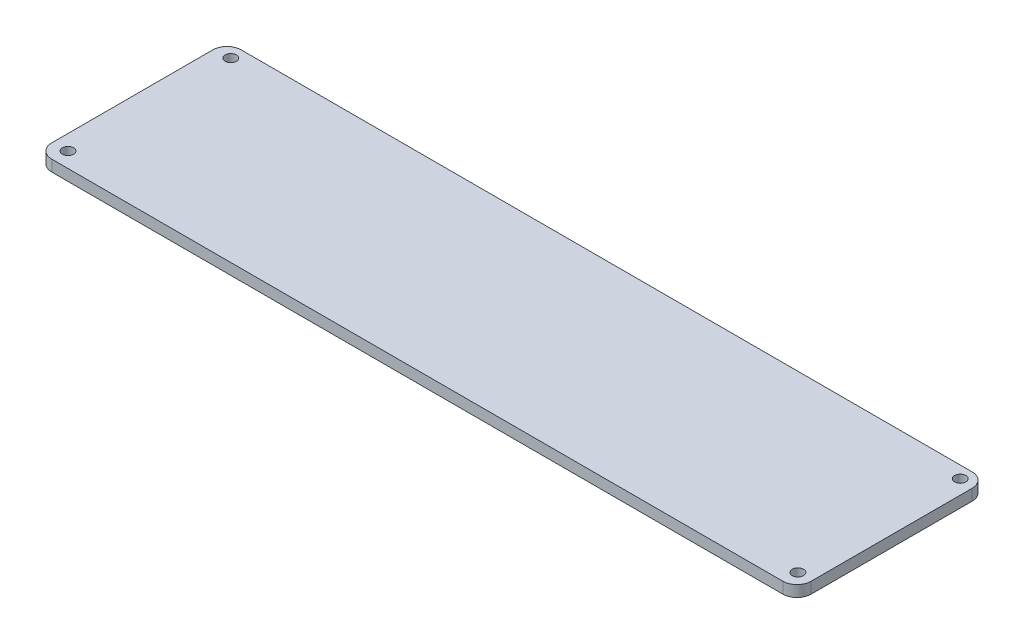
ISO-10303-21;
HEADER;
FILE_DESCRIPTION(('STEP AP214'),'2;1');
FILE_NAME('part.step','',(''),(''),'','','');
FILE_SCHEMA(('AUTOMOTIVE_DESIGN { 1 0 10303 214 1 1 1 1 }'));
ENDSEC;
DATA;
#1=APPLICATION_CONTEXT('core data for automotive mechanical design processes');
#2=APPLICATION_PROTOCOL_DEFINITION('international standard','automotive_design',2000,#1);
#3=PRODUCT_CONTEXT('',#1,'mechanical');
#4=PRODUCT('Part','Part','',(#3));
#5=PRODUCT_RELATED_PRODUCT_CATEGORY('part','',(#4));
#6=PRODUCT_DEFINITION_FORMATION('','',#4);
#7=PRODUCT_DEFINITION_CONTEXT('part definition',#1,'design');
#8=PRODUCT_DEFINITION('design','',#6,#7);
#9=PRODUCT_DEFINITION_SHAPE('','',#8);
#10=(LENGTH_UNIT() NAMED_UNIT(*) SI_UNIT(.MILLI.,.METRE.));
#11=(NAMED_UNIT(*) PLANE_ANGLE_UNIT() SI_UNIT($,.RADIAN.));
#12=(NAMED_UNIT(*) SI_UNIT($,.STERADIAN.) SOLID_ANGLE_UNIT());
#13=UNCERTAINTY_MEASURE_WITH_UNIT(LENGTH_MEASURE(1.E-05),#10,'distance_accuracy_value','');
#14=(GEOMETRIC_REPRESENTATION_CONTEXT(3) GLOBAL_UNCERTAINTY_ASSIGNED_CONTEXT((#13)) GLOBAL_UNIT_ASSIGNED_CONTEXT((#10,
#11,#12)) REPRESENTATION_CONTEXT('',''));
#15=CARTESIAN_POINT('',(0.,0.,0.));
#16=DIRECTION('',(0.,0.,1.));
#17=DIRECTION('',(1.,0.,0.));
#18=AXIS2_PLACEMENT_3D('',#15,#16,#17);
#19=CARTESIAN_POINT('',(0.,3.,24.3535233685462));
#20=DIRECTION('',(0.,0.,-1.));
#21=DIRECTION('',(-1.,0.,0.));
#22=AXIS2_PLACEMENT_3D('',#19,#20,#21);
#23=PLANE('',#22);
#24=DIRECTION('',(1.,0.,0.));
#25=VECTOR('',#24,1.);
#26=CARTESIAN_POINT('',(0.,0.,24.3535233685462));
#27=LINE('',#26,#25);
#28=CARTESIAN_POINT('',(-98.5863813051631,0.,24.3535233685462));
#29=VERTEX_POINT('',#28);
#30=CARTESIAN_POINT('',(97.0136186948369,0.,24.3535233685462));
#31=VERTEX_POINT('',#30);
#32=EDGE_CURVE('E106',#29,#31,#27,.T.);
#33=ORIENTED_EDGE('',*,*,#32,.T.);
#34=DIRECTION('',(0.,-1.,0.));
#35=VECTOR('',#34,1.);
#36=CARTESIAN_POINT('',(97.0136186948369,3.,24.3535233685462));
#37=LINE('',#36,#35);
#38=CARTESIAN_POINT('',(97.0136186948369,3.,24.3535233685462));
#39=VERTEX_POINT('',#38);
#40=EDGE_CURVE('E11',#31,#39,#37,.F.);
#41=ORIENTED_EDGE('',*,*,#40,.T.);
#42=DIRECTION('',(1.,0.,0.));
#43=VECTOR('',#42,1.);
#44=CARTESIAN_POINT('',(0.,3.,24.3535233685462));
#45=LINE('',#44,#43);
#46=CARTESIAN_POINT('',(-98.5863813051631,3.,24.3535233685462));
#47=VERTEX_POINT('',#46);
#48=EDGE_CURVE('E155',#47,#39,#45,.T.);
#49=ORIENTED_EDGE('',*,*,#48,.F.);
#50=DIRECTION('',(0.,-1.,0.));
#51=VECTOR('',#50,1.);
#52=CARTESIAN_POINT('',(-98.5863813051631,0.,24.3535233685462));
#53=LINE('',#52,#51);
#54=EDGE_CURVE('E43',#47,#29,#53,.T.);
#55=ORIENTED_EDGE('',*,*,#54,.T.);
#56=EDGE_LOOP('',(#33,#41,#49,#55));
#57=FACE_BOUND('',#56,.T.);
#58=ADVANCED_FACE('F35',(#57),#23,.F.);
#59=CARTESIAN_POINT('',(100.813618694837,3.,0.));
#60=DIRECTION('',(-1.,0.,0.));
#61=DIRECTION('',(0.,0.,1.));
#62=AXIS2_PLACEMENT_3D('',#59,#60,#61);
#63=PLANE('',#62);
#64=DIRECTION('',(0.,0.,-1.));
#65=VECTOR('',#64,1.);
#66=CARTESIAN_POINT('',(100.813618694837,0.,0.));
#67=LINE('',#66,#65);
#68=CARTESIAN_POINT('',(100.813618694837,0.,20.5535233685462));
#69=VERTEX_POINT('',#68);
#70=CARTESIAN_POINT('',(100.813618694837,0.,-22.5194766314538));
#71=VERTEX_POINT('',#70);
#72=EDGE_CURVE('E180',#69,#71,#67,.T.);
#73=ORIENTED_EDGE('',*,*,#72,.T.);
#74=DIRECTION('',(0.,-1.,0.));
#75=VECTOR('',#74,1.);
#76=CARTESIAN_POINT('',(100.813618694837,3.,-22.5194766314538));
#77=LINE('',#76,#75);
#78=CARTESIAN_POINT('',(100.813618694837,3.,-22.5194766314538));
#79=VERTEX_POINT('',#78);
#80=EDGE_CURVE('E50',#71,#79,#77,.F.);
#81=ORIENTED_EDGE('',*,*,#80,.T.);
#82=DIRECTION('',(0.,0.,-1.));
#83=VECTOR('',#82,1.);
#84=CARTESIAN_POINT('',(100.813618694837,3.,0.));
#85=LINE('',#84,#83);
#86=CARTESIAN_POINT('',(100.813618694837,3.,20.5535233685462));
#87=VERTEX_POINT('',#86);
#88=EDGE_CURVE('E156',#87,#79,#85,.T.);
#89=ORIENTED_EDGE('',*,*,#88,.F.);
#90=DIRECTION('',(0.,-1.,0.));
#91=VECTOR('',#90,1.);
#92=CARTESIAN_POINT('',(100.813618694837,3.,20.5535233685462));
#93=LINE('',#92,#91);
#94=EDGE_CURVE('E149',#87,#69,#93,.T.);
#95=ORIENTED_EDGE('',*,*,#94,.T.);
#96=EDGE_LOOP('',(#73,#81,#89,#95));
#97=FACE_BOUND('',#96,.T.);
#98=ADVANCED_FACE('F206',(#97),#63,.F.);
#99=CARTESIAN_POINT('',(0.,3.,-26.3194766314538));
#100=DIRECTION('',(0.,0.,-1.));
#101=DIRECTION('',(-1.,0.,0.));
#102=AXIS2_PLACEMENT_3D('',#99,#100,#101);
#103=PLANE('',#102);
#104=DIRECTION('',(1.,0.,0.));
#105=VECTOR('',#104,1.);
#106=CARTESIAN_POINT('',(0.,0.,-26.3194766314538));
#107=LINE('',#106,#105);
#108=CARTESIAN_POINT('',(-98.5863813051631,0.,-26.3194766314538));
#109=VERTEX_POINT('',#108);
#110=CARTESIAN_POINT('',(97.0136186948369,0.,-26.3194766314538));
#111=VERTEX_POINT('',#110);
#112=EDGE_CURVE('E122',#109,#111,#107,.T.);
#113=ORIENTED_EDGE('',*,*,#112,.F.);
#114=DIRECTION('',(0.,-1.,0.));
#115=VECTOR('',#114,1.);
#116=CARTESIAN_POINT('',(-98.5863813051631,3.,-26.3194766314538));
#117=LINE('',#116,#115);
#118=CARTESIAN_POINT('',(-98.5863813051631,3.,-26.3194766314538));
#119=VERTEX_POINT('',#118);
#120=EDGE_CURVE('E141',#109,#119,#117,.F.);
#121=ORIENTED_EDGE('',*,*,#120,.T.);
#122=DIRECTION('',(1.,0.,0.));
#123=VECTOR('',#122,1.);
#124=CARTESIAN_POINT('',(0.,3.,-26.3194766314538));
#125=LINE('',#124,#123);
#126=CARTESIAN_POINT('',(97.0136186948369,3.,-26.3194766314538));
#127=VERTEX_POINT('',#126);
#128=EDGE_CURVE('E129',#119,#127,#125,.T.);
#129=ORIENTED_EDGE('',*,*,#128,.T.);
#130=DIRECTION('',(0.,-1.,0.));
#131=VECTOR('',#130,1.);
#132=CARTESIAN_POINT('',(97.0136186948369,0.,-26.3194766314538));
#133=LINE('',#132,#131);
#134=EDGE_CURVE('E138',#127,#111,#133,.T.);
#135=ORIENTED_EDGE('',*,*,#134,.T.);
#136=EDGE_LOOP('',(#113,#121,#129,#135));
#137=FACE_BOUND('',#136,.T.);
#138=ADVANCED_FACE('F186',(#137),#103,.T.);
#139=CARTESIAN_POINT('',(-98.3223813051631,3.,20.2895233685462));
#140=DIRECTION('',(0.,-1.,0.));
#141=DIRECTION('',(0.,0.,-1.));
#142=AXIS2_PLACEMENT_3D('',#139,#140,#141);
#143=CYLINDRICAL_SURFACE('',#142,1.5);
#144=CARTESIAN_POINT('',(-98.3223813051631,3.,20.2895233685462));
#145=DIRECTION('',(0.,1.,0.));
#146=DIRECTION('',(0.,0.,1.));
#147=AXIS2_PLACEMENT_3D('',#144,#145,#146);
#148=CIRCLE('',#147,1.5);
#149=CARTESIAN_POINT('',(-98.3223813051631,3.,21.7895233685462));
#150=VERTEX_POINT('',#149);
#151=EDGE_CURVE('E157',#150,#150,#148,.T.);
#152=ORIENTED_EDGE('',*,*,#151,.T.);
#153=EDGE_LOOP('',(#152));
#154=FACE_BOUND('',#153,.T.);
#155=CARTESIAN_POINT('',(-98.3223813051631,0.,20.2895233685462));
#156=DIRECTION('',(0.,1.,0.));
#157=DIRECTION('',(0.,0.,1.));
#158=AXIS2_PLACEMENT_3D('',#155,#156,#157);
#159=CIRCLE('',#158,1.5);
#160=CARTESIAN_POINT('',(-98.3223813051631,0.,21.7895233685462));
#161=VERTEX_POINT('',#160);
#162=EDGE_CURVE('E176',#161,#161,#159,.T.);
#163=ORIENTED_EDGE('',*,*,#162,.F.);
#164=EDGE_LOOP('',(#163));
#165=FACE_BOUND('',#164,.T.);
#166=ADVANCED_FACE('F214',(#154,#165),#143,.F.);
#167=CARTESIAN_POINT('',(-98.0683813051631,3.,-23.0174766314538));
#168=DIRECTION('',(0.,-1.,0.));
#169=DIRECTION('',(0.,0.,-1.));
#170=AXIS2_PLACEMENT_3D('',#167,#168,#169);
#171=CYLINDRICAL_SURFACE('',#170,1.5);
#172=CARTESIAN_POINT('',(-98.0683813051631,3.,-23.0174766314538));
#173=DIRECTION('',(0.,1.,0.));
#174=DIRECTION('',(0.,0.,1.));
#175=AXIS2_PLACEMENT_3D('',#172,#173,#174);
#176=CIRCLE('',#175,1.5);
#177=CARTESIAN_POINT('',(-98.0683813051631,3.,-21.5174766314538));
#178=VERTEX_POINT('',#177);
#179=EDGE_CURVE('E161',#178,#178,#176,.T.);
#180=ORIENTED_EDGE('',*,*,#179,.T.);
#181=EDGE_LOOP('',(#180));
#182=FACE_BOUND('',#181,.T.);
#183=CARTESIAN_POINT('',(-98.0683813051631,0.,-23.0174766314538));
#184=DIRECTION('',(0.,1.,0.));
#185=DIRECTION('',(0.,0.,1.));
#186=AXIS2_PLACEMENT_3D('',#183,#184,#185);
#187=CIRCLE('',#186,1.5);
#188=CARTESIAN_POINT('',(-98.0683813051631,0.,-21.5174766314538));
#189=VERTEX_POINT('',#188);
#190=EDGE_CURVE('E173',#189,#189,#187,.T.);
#191=ORIENTED_EDGE('',*,*,#190,.F.);
#192=EDGE_LOOP('',(#191));
#193=FACE_BOUND('',#192,.T.);
#194=ADVANCED_FACE('F217',(#182,#193),#171,.F.);
#195=CARTESIAN_POINT('',(97.0036186948369,3.,-23.1444766314538));
#196=DIRECTION('',(0.,-1.,0.));
#197=DIRECTION('',(0.,0.,-1.));
#198=AXIS2_PLACEMENT_3D('',#195,#196,#197);
#199=CYLINDRICAL_SURFACE('',#198,1.5);
#200=CARTESIAN_POINT('',(97.0036186948369,3.,-23.1444766314538));
#201=DIRECTION('',(0.,1.,0.));
#202=DIRECTION('',(0.,0.,1.));
#203=AXIS2_PLACEMENT_3D('',#200,#201,#202);
#204=CIRCLE('',#203,1.5);
#205=CARTESIAN_POINT('',(97.0036186948369,3.,-21.6444766314538));
#206=VERTEX_POINT('',#205);
#207=EDGE_CURVE('E339',#206,#206,#204,.T.);
#208=ORIENTED_EDGE('',*,*,#207,.T.);
#209=EDGE_LOOP('',(#208));
#210=FACE_BOUND('',#209,.T.);
#211=CARTESIAN_POINT('',(97.0036186948369,0.,-23.1444766314538));
#212=DIRECTION('',(0.,1.,0.));
#213=DIRECTION('',(0.,0.,1.));
#214=AXIS2_PLACEMENT_3D('',#211,#212,#213);
#215=CIRCLE('',#214,1.5);
#216=CARTESIAN_POINT('',(97.0036186948369,0.,-21.6444766314538));
#217=VERTEX_POINT('',#216);
#218=EDGE_CURVE('E170',#217,#217,#215,.T.);
#219=ORIENTED_EDGE('',*,*,#218,.F.);
#220=EDGE_LOOP('',(#219));
#221=FACE_BOUND('',#220,.T.);
#222=ADVANCED_FACE('F221',(#210,#221),#199,.F.);
#223=CARTESIAN_POINT('',(97.0036186948369,3.,20.2895233685462));
#224=DIRECTION('',(0.,-1.,0.));
#225=DIRECTION('',(0.,0.,-1.));
#226=AXIS2_PLACEMENT_3D('',#223,#224,#225);
#227=CYLINDRICAL_SURFACE('',#226,1.5);
#228=CARTESIAN_POINT('',(97.0036186948369,3.,20.2895233685462));
#229=DIRECTION('',(0.,1.,0.));
#230=DIRECTION('',(0.,0.,1.));
#231=AXIS2_PLACEMENT_3D('',#228,#229,#230);
#232=CIRCLE('',#231,1.5);
#233=CARTESIAN_POINT('',(97.0036186948369,3.,21.7895233685462));
#234=VERTEX_POINT('',#233);
#235=EDGE_CURVE('E121',#234,#234,#232,.T.);
#236=ORIENTED_EDGE('',*,*,#235,.T.);
#237=EDGE_LOOP('',(#236));
#238=FACE_BOUND('',#237,.T.);
#239=CARTESIAN_POINT('',(97.0036186948369,0.,20.2895233685462));
#240=DIRECTION('',(0.,1.,0.));
#241=DIRECTION('',(0.,0.,1.));
#242=AXIS2_PLACEMENT_3D('',#239,#240,#241);
#243=CIRCLE('',#242,1.5);
#244=CARTESIAN_POINT('',(97.0036186948369,0.,21.7895233685462));
#245=VERTEX_POINT('',#244);
#246=EDGE_CURVE('E167',#245,#245,#243,.T.);
#247=ORIENTED_EDGE('',*,*,#246,.F.);
#248=EDGE_LOOP('',(#247));
#249=FACE_BOUND('',#248,.T.);
#250=ADVANCED_FACE('F225',(#238,#249),#227,.F.);
#251=CARTESIAN_POINT('',(-102.386381305163,3.,0.));
#252=DIRECTION('',(-1.,0.,0.));
#253=DIRECTION('',(0.,0.,1.));
#254=AXIS2_PLACEMENT_3D('',#251,#252,#253);
#255=PLANE('',#254);
#256=DIRECTION('',(0.,0.,-1.));
#257=VECTOR('',#256,1.);
#258=CARTESIAN_POINT('',(-102.386381305163,3.,0.));
#259=LINE('',#258,#257);
#260=CARTESIAN_POINT('',(-102.386381305163,3.,20.5535233685462));
#261=VERTEX_POINT('',#260);
#262=CARTESIAN_POINT('',(-102.386381305163,3.,-22.5194766314538));
#263=VERTEX_POINT('',#262);
#264=EDGE_CURVE('E126',#261,#263,#259,.T.);
#265=ORIENTED_EDGE('',*,*,#264,.T.);
#266=DIRECTION('',(0.,-1.,0.));
#267=VECTOR('',#266,1.);
#268=CARTESIAN_POINT('',(-102.386381305163,3.,-22.5194766314538));
#269=LINE('',#268,#267);
#270=CARTESIAN_POINT('',(-102.386381305163,0.,-22.5194766314538));
#271=VERTEX_POINT('',#270);
#272=EDGE_CURVE('E112',#263,#271,#269,.T.);
#273=ORIENTED_EDGE('',*,*,#272,.T.);
#274=DIRECTION('',(0.,0.,-1.));
#275=VECTOR('',#274,1.);
#276=CARTESIAN_POINT('',(-102.386381305163,0.,0.));
#277=LINE('',#276,#275);
#278=CARTESIAN_POINT('',(-102.386381305163,0.,20.5535233685462));
#279=VERTEX_POINT('',#278);
#280=EDGE_CURVE('E104',#279,#271,#277,.T.);
#281=ORIENTED_EDGE('',*,*,#280,.F.);
#282=DIRECTION('',(0.,-1.,0.));
#283=VECTOR('',#282,1.);
#284=CARTESIAN_POINT('',(-102.386381305163,3.,20.5535233685462));
#285=LINE('',#284,#283);
#286=EDGE_CURVE('E118',#279,#261,#285,.F.);
#287=ORIENTED_EDGE('',*,*,#286,.T.);
#288=EDGE_LOOP('',(#265,#273,#281,#287));
#289=FACE_BOUND('',#288,.T.);
#290=ADVANCED_FACE('F117',(#289),#255,.T.);
#291=CARTESIAN_POINT('',(0.,3.,0.));
#292=DIRECTION('',(0.,1.,0.));
#293=DIRECTION('',(0.,0.,1.));
#294=AXIS2_PLACEMENT_3D('',#291,#292,#293);
#295=PLANE('',#294);
#296=ORIENTED_EDGE('',*,*,#235,.F.);
#297=EDGE_LOOP('',(#296));
#298=FACE_BOUND('',#297,.T.);
#299=ORIENTED_EDGE('',*,*,#207,.F.);
#300=EDGE_LOOP('',(#299));
#301=FACE_BOUND('',#300,.T.);
#302=ORIENTED_EDGE('',*,*,#179,.F.);
#303=EDGE_LOOP('',(#302));
#304=FACE_BOUND('',#303,.T.);
#305=ORIENTED_EDGE('',*,*,#151,.F.);
#306=EDGE_LOOP('',(#305));
#307=FACE_BOUND('',#306,.T.);
#308=ORIENTED_EDGE('',*,*,#128,.F.);
#309=CARTESIAN_POINT('',(-98.5863813051631,3.,-22.5194766314538));
#310=DIRECTION('',(0.,1.,0.));
#311=DIRECTION('',(0.,0.,1.));
#312=AXIS2_PLACEMENT_3D('',#309,#310,#311);
#313=CIRCLE('',#312,3.8);
#314=EDGE_CURVE('E147',#119,#263,#313,.T.);
#315=ORIENTED_EDGE('',*,*,#314,.T.);
#316=ORIENTED_EDGE('',*,*,#264,.F.);
#317=CARTESIAN_POINT('',(-98.5863813051631,3.,20.5535233685462));
#318=DIRECTION('',(0.,1.,0.));
#319=DIRECTION('',(0.,0.,1.));
#320=AXIS2_PLACEMENT_3D('',#317,#318,#319);
#321=CIRCLE('',#320,3.8);
#322=EDGE_CURVE('E125',#261,#47,#321,.T.);
#323=ORIENTED_EDGE('',*,*,#322,.T.);
#324=ORIENTED_EDGE('',*,*,#48,.T.);
#325=CARTESIAN_POINT('',(97.0136186948369,3.,20.5535233685462));
#326=DIRECTION('',(0.,1.,0.));
#327=DIRECTION('',(0.,0.,1.));
#328=AXIS2_PLACEMENT_3D('',#325,#326,#327);
#329=CIRCLE('',#328,3.8);
#330=EDGE_CURVE('E57',#39,#87,#329,.T.);
#331=ORIENTED_EDGE('',*,*,#330,.T.);
#332=ORIENTED_EDGE('',*,*,#88,.T.);
#333=CARTESIAN_POINT('',(97.0136186948369,3.,-22.5194766314538));
#334=DIRECTION('',(0.,1.,0.));
#335=DIRECTION('',(0.,0.,1.));
#336=AXIS2_PLACEMENT_3D('',#333,#334,#335);
#337=CIRCLE('',#336,3.8);
#338=EDGE_CURVE('E145',#79,#127,#337,.T.);
#339=ORIENTED_EDGE('',*,*,#338,.T.);
#340=EDGE_LOOP('',(#308,#315,#316,#323,#324,#331,#332,#339));
#341=FACE_BOUND('',#340,.T.);
#342=ADVANCED_FACE('F192',(#298,#301,#304,#307,#341),#295,.T.);
#343=CARTESIAN_POINT('',(0.,0.,0.));
#344=DIRECTION('',(0.,1.,0.));
#345=DIRECTION('',(0.,0.,1.));
#346=AXIS2_PLACEMENT_3D('',#343,#344,#345);
#347=PLANE('',#346);
#348=ORIENTED_EDGE('',*,*,#246,.T.);
#349=EDGE_LOOP('',(#348));
#350=FACE_BOUND('',#349,.T.);
#351=ORIENTED_EDGE('',*,*,#218,.T.);
#352=EDGE_LOOP('',(#351));
#353=FACE_BOUND('',#352,.T.);
#354=ORIENTED_EDGE('',*,*,#190,.T.);
#355=EDGE_LOOP('',(#354));
#356=FACE_BOUND('',#355,.T.);
#357=ORIENTED_EDGE('',*,*,#162,.T.);
#358=EDGE_LOOP('',(#357));
#359=FACE_BOUND('',#358,.T.);
#360=ORIENTED_EDGE('',*,*,#280,.T.);
#361=CARTESIAN_POINT('',(-98.5863813051631,0.,-22.5194766314538));
#362=DIRECTION('',(0.,1.,0.));
#363=DIRECTION('',(0.,0.,1.));
#364=AXIS2_PLACEMENT_3D('',#361,#362,#363);
#365=CIRCLE('',#364,3.8);
#366=EDGE_CURVE('E136',#271,#109,#365,.F.);
#367=ORIENTED_EDGE('',*,*,#366,.T.);
#368=ORIENTED_EDGE('',*,*,#112,.T.);
#369=CARTESIAN_POINT('',(97.0136186948369,0.,-22.5194766314538));
#370=DIRECTION('',(0.,1.,0.));
#371=DIRECTION('',(0.,0.,1.));
#372=AXIS2_PLACEMENT_3D('',#369,#370,#371);
#373=CIRCLE('',#372,3.8);
#374=EDGE_CURVE('E134',#111,#71,#373,.F.);
#375=ORIENTED_EDGE('',*,*,#374,.T.);
#376=ORIENTED_EDGE('',*,*,#72,.F.);
#377=CARTESIAN_POINT('',(97.0136186948369,0.,20.5535233685462));
#378=DIRECTION('',(0.,1.,0.));
#379=DIRECTION('',(0.,0.,1.));
#380=AXIS2_PLACEMENT_3D('',#377,#378,#379);
#381=CIRCLE('',#380,3.8);
#382=EDGE_CURVE('E111',#69,#31,#381,.F.);
#383=ORIENTED_EDGE('',*,*,#382,.T.);
#384=ORIENTED_EDGE('',*,*,#32,.F.);
#385=CARTESIAN_POINT('',(-98.5863813051631,0.,20.5535233685462));
#386=DIRECTION('',(0.,1.,0.));
#387=DIRECTION('',(0.,0.,1.));
#388=AXIS2_PLACEMENT_3D('',#385,#386,#387);
#389=CIRCLE('',#388,3.8);
#390=EDGE_CURVE('E101',#29,#279,#389,.F.);
#391=ORIENTED_EDGE('',*,*,#390,.T.);
#392=EDGE_LOOP('',(#360,#367,#368,#375,#376,#383,#384,#391));
#393=FACE_BOUND('',#392,.T.);
#394=ADVANCED_FACE('F103',(#350,#353,#356,#359,#393),#347,.F.);
#395=CARTESIAN_POINT('',(-98.5863813051631,3.,-22.5194766314538));
#396=DIRECTION('',(0.,-1.,0.));
#397=DIRECTION('',(0.,0.,-1.));
#398=AXIS2_PLACEMENT_3D('',#395,#396,#397);
#399=CYLINDRICAL_SURFACE('',#398,3.8);
#400=ORIENTED_EDGE('',*,*,#314,.F.);
#401=ORIENTED_EDGE('',*,*,#120,.F.);
#402=ORIENTED_EDGE('',*,*,#366,.F.);
#403=ORIENTED_EDGE('',*,*,#272,.F.);
#404=EDGE_LOOP('',(#400,#401,#402,#403));
#405=FACE_BOUND('',#404,.T.);
#406=ADVANCED_FACE('F191',(#405),#399,.T.);
#407=CARTESIAN_POINT('',(97.0136186948369,3.,-22.5194766314538));
#408=DIRECTION('',(0.,1.,0.));
#409=DIRECTION('',(0.,0.,1.));
#410=AXIS2_PLACEMENT_3D('',#407,#408,#409);
#411=CYLINDRICAL_SURFACE('',#410,3.8);
#412=ORIENTED_EDGE('',*,*,#338,.F.);
#413=ORIENTED_EDGE('',*,*,#80,.F.);
#414=ORIENTED_EDGE('',*,*,#374,.F.);
#415=ORIENTED_EDGE('',*,*,#134,.F.);
#416=EDGE_LOOP('',(#412,#413,#414,#415));
#417=FACE_BOUND('',#416,.T.);
#418=ADVANCED_FACE('F195',(#417),#411,.T.);
#419=CARTESIAN_POINT('',(97.0136186948369,3.,20.5535233685462));
#420=DIRECTION('',(0.,-1.,0.));
#421=DIRECTION('',(0.,0.,-1.));
#422=AXIS2_PLACEMENT_3D('',#419,#420,#421);
#423=CYLINDRICAL_SURFACE('',#422,3.8);
#424=ORIENTED_EDGE('',*,*,#330,.F.);
#425=ORIENTED_EDGE('',*,*,#40,.F.);
#426=ORIENTED_EDGE('',*,*,#382,.F.);
#427=ORIENTED_EDGE('',*,*,#94,.F.);
#428=EDGE_LOOP('',(#424,#425,#426,#427));
#429=FACE_BOUND('',#428,.T.);
#430=ADVANCED_FACE('F197',(#429),#423,.T.);
#431=CARTESIAN_POINT('',(-98.5863813051631,3.,20.5535233685462));
#432=DIRECTION('',(0.,1.,0.));
#433=DIRECTION('',(0.,0.,1.));
#434=AXIS2_PLACEMENT_3D('',#431,#432,#433);
#435=CYLINDRICAL_SURFACE('',#434,3.8);
#436=ORIENTED_EDGE('',*,*,#322,.F.);
#437=ORIENTED_EDGE('',*,*,#286,.F.);
#438=ORIENTED_EDGE('',*,*,#390,.F.);
#439=ORIENTED_EDGE('',*,*,#54,.F.);
#440=EDGE_LOOP('',(#436,#437,#438,#439));
#441=FACE_BOUND('',#440,.T.);
#442=ADVANCED_FACE('F37',(#441),#435,.T.);
#443=CLOSED_SHELL('',(#58,#98,#138,#166,#194,#222,#250,#290,#342,#394,#406,#418,#430,#442));
#444=MANIFOLD_SOLID_BREP('B2',#443);
#445=ADVANCED_BREP_SHAPE_REPRESENTATION('',(#18,#444),#14);
#446=SHAPE_DEFINITION_REPRESENTATION(#9,#445);
ENDSEC;
END-ISO-10303-21;
